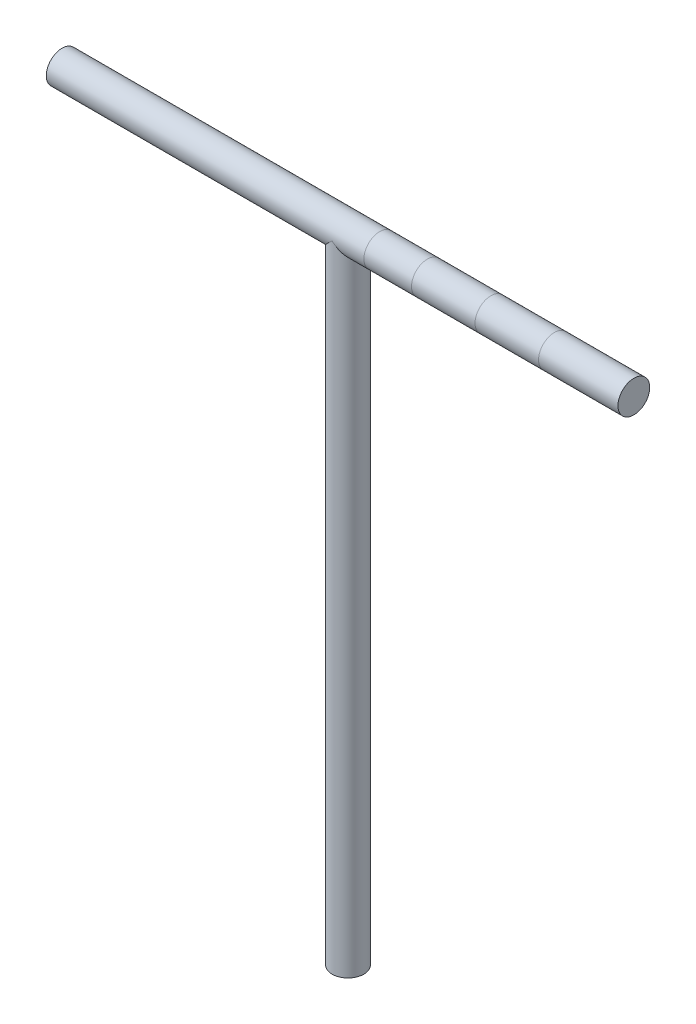
ISO-10303-21;
HEADER;
FILE_DESCRIPTION(('STEP AP214'),'2;1');
FILE_NAME('part.step','',(''),(''),'','','');
FILE_SCHEMA(('AUTOMOTIVE_DESIGN { 1 0 10303 214 1 1 1 1 }'));
ENDSEC;
DATA;
#1=APPLICATION_CONTEXT('core data for automotive mechanical design processes');
#2=APPLICATION_PROTOCOL_DEFINITION('international standard','automotive_design',2000,#1);
#3=PRODUCT_CONTEXT('',#1,'mechanical');
#4=PRODUCT('Part','Part','',(#3));
#5=PRODUCT_RELATED_PRODUCT_CATEGORY('part','',(#4));
#6=PRODUCT_DEFINITION_FORMATION('','',#4);
#7=PRODUCT_DEFINITION_CONTEXT('part definition',#1,'design');
#8=PRODUCT_DEFINITION('design','',#6,#7);
#9=PRODUCT_DEFINITION_SHAPE('','',#8);
#10=(LENGTH_UNIT() NAMED_UNIT(*) SI_UNIT(.MILLI.,.METRE.));
#11=(NAMED_UNIT(*) PLANE_ANGLE_UNIT() SI_UNIT($,.RADIAN.));
#12=(NAMED_UNIT(*) SI_UNIT($,.STERADIAN.) SOLID_ANGLE_UNIT());
#13=UNCERTAINTY_MEASURE_WITH_UNIT(LENGTH_MEASURE(1.E-05),#10,'distance_accuracy_value','');
#14=(GEOMETRIC_REPRESENTATION_CONTEXT(3) GLOBAL_UNCERTAINTY_ASSIGNED_CONTEXT((#13)) GLOBAL_UNIT_ASSIGNED_CONTEXT((#10,
#11,#12)) REPRESENTATION_CONTEXT('',''));
#15=CARTESIAN_POINT('',(0.,0.,0.));
#16=DIRECTION('',(0.,0.,1.));
#17=DIRECTION('',(1.,0.,0.));
#18=AXIS2_PLACEMENT_3D('',#15,#16,#17);
#19=CARTESIAN_POINT('',(90.,0.,0.));
#20=DIRECTION('',(-1.,0.,0.));
#21=DIRECTION('',(0.,0.,1.));
#22=AXIS2_PLACEMENT_3D('',#19,#20,#21);
#23=CYLINDRICAL_SURFACE('',#22,5.);
#24=CARTESIAN_POINT('',(90.,0.,0.));
#25=DIRECTION('',(1.,0.,0.));
#26=DIRECTION('',(0.,0.,-1.));
#27=AXIS2_PLACEMENT_3D('',#24,#25,#26);
#28=CIRCLE('',#27,5.);
#29=CARTESIAN_POINT('',(90.,0.,-5.));
#30=VERTEX_POINT('',#29);
#31=EDGE_CURVE('E68',#30,#30,#28,.T.);
#32=ORIENTED_EDGE('',*,*,#31,.F.);
#33=EDGE_LOOP('',(#32));
#34=FACE_BOUND('',#33,.T.);
#35=CARTESIAN_POINT('',(65.,0.,0.));
#36=DIRECTION('',(1.,0.,0.));
#37=DIRECTION('',(0.,0.,-1.));
#38=AXIS2_PLACEMENT_3D('',#35,#36,#37);
#39=CIRCLE('',#38,5.);
#40=CARTESIAN_POINT('',(65.,0.,-5.));
#41=VERTEX_POINT('',#40);
#42=EDGE_CURVE('E55',#41,#41,#39,.T.);
#43=ORIENTED_EDGE('',*,*,#42,.T.);
#44=EDGE_LOOP('',(#43));
#45=FACE_BOUND('',#44,.T.);
#46=ADVANCED_FACE('F39',(#34,#45),#23,.T.);
#47=ORIENTED_EDGE('',*,*,#42,.F.);
#48=EDGE_LOOP('',(#47));
#49=FACE_BOUND('',#48,.T.);
#50=CARTESIAN_POINT('',(45.,0.,0.));
#51=DIRECTION('',(1.,0.,0.));
#52=DIRECTION('',(0.,0.,-1.));
#53=AXIS2_PLACEMENT_3D('',#50,#51,#52);
#54=CIRCLE('',#53,5.);
#55=CARTESIAN_POINT('',(45.,0.,-5.));
#56=VERTEX_POINT('',#55);
#57=EDGE_CURVE('E80',#56,#56,#54,.T.);
#58=ORIENTED_EDGE('',*,*,#57,.T.);
#59=EDGE_LOOP('',(#58));
#60=FACE_BOUND('',#59,.T.);
#61=ADVANCED_FACE('F87',(#49,#60),#23,.T.);
#62=ORIENTED_EDGE('',*,*,#57,.F.);
#63=EDGE_LOOP('',(#62));
#64=FACE_BOUND('',#63,.T.);
#65=CARTESIAN_POINT('',(25.,0.,0.));
#66=DIRECTION('',(1.,0.,0.));
#67=DIRECTION('',(0.,0.,-1.));
#68=AXIS2_PLACEMENT_3D('',#65,#66,#67);
#69=CIRCLE('',#68,5.);
#70=CARTESIAN_POINT('',(25.,0.,-5.));
#71=VERTEX_POINT('',#70);
#72=EDGE_CURVE('E77',#71,#71,#69,.T.);
#73=ORIENTED_EDGE('',*,*,#72,.T.);
#74=EDGE_LOOP('',(#73));
#75=FACE_BOUND('',#74,.T.);
#76=ADVANCED_FACE('F90',(#64,#75),#23,.T.);
#77=ORIENTED_EDGE('',*,*,#72,.F.);
#78=EDGE_LOOP('',(#77));
#79=FACE_BOUND('',#78,.T.);
#80=CARTESIAN_POINT('',(9.99999999999999,0.,0.));
#81=DIRECTION('',(1.,0.,0.));
#82=DIRECTION('',(0.,0.,-1.));
#83=AXIS2_PLACEMENT_3D('',#80,#81,#82);
#84=CIRCLE('',#83,5.);
#85=CARTESIAN_POINT('',(9.99999999999999,0.,-5.));
#86=VERTEX_POINT('',#85);
#87=EDGE_CURVE('E63',#86,#86,#84,.T.);
#88=ORIENTED_EDGE('',*,*,#87,.T.);
#89=EDGE_LOOP('',(#88));
#90=FACE_BOUND('',#89,.T.);
#91=ADVANCED_FACE('F59',(#79,#90),#23,.T.);
#92=CARTESIAN_POINT('',(0.,0.,0.));
#93=DIRECTION('',(-0.707106781186547,-0.707106781186548,0.));
#94=DIRECTION('',(-0.707106781186547,0.707106781186548,0.));
#95=AXIS2_PLACEMENT_3D('',#92,#93,#94);
#96=ELLIPSE('',#95,7.07106781186547,5.);
#97=CARTESIAN_POINT('',(0.,0.,5.));
#98=VERTEX_POINT('',#97);
#99=CARTESIAN_POINT('',(0.,0.,-5.));
#100=VERTEX_POINT('',#99);
#101=EDGE_CURVE('E47',#98,#100,#96,.F.);
#102=ORIENTED_EDGE('',*,*,#101,.T.);
#103=CARTESIAN_POINT('',(0.,0.,0.));
#104=DIRECTION('',(-0.707106781186547,0.707106781186548,0.));
#105=DIRECTION('',(-0.707106781186547,-0.707106781186548,0.));
#106=AXIS2_PLACEMENT_3D('',#103,#104,#105);
#107=ELLIPSE('',#106,7.07106781186547,5.);
#108=EDGE_CURVE('E12',#100,#98,#107,.T.);
#109=ORIENTED_EDGE('',*,*,#108,.T.);
#110=EDGE_LOOP('',(#102,#109));
#111=FACE_BOUND('',#110,.T.);
#112=ORIENTED_EDGE('',*,*,#87,.F.);
#113=EDGE_LOOP('',(#112));
#114=FACE_BOUND('',#113,.T.);
#115=CARTESIAN_POINT('',(-90.,0.,0.));
#116=DIRECTION('',(1.,0.,0.));
#117=DIRECTION('',(0.,0.,-1.));
#118=AXIS2_PLACEMENT_3D('',#115,#116,#117);
#119=CIRCLE('',#118,5.);
#120=CARTESIAN_POINT('',(-90.,0.,-5.));
#121=VERTEX_POINT('',#120);
#122=EDGE_CURVE('E66',#121,#121,#119,.T.);
#123=ORIENTED_EDGE('',*,*,#122,.T.);
#124=EDGE_LOOP('',(#123));
#125=FACE_BOUND('',#124,.T.);
#126=ADVANCED_FACE('F41',(#111,#114,#125),#23,.T.);
#127=CARTESIAN_POINT('',(90.,0.,0.));
#128=DIRECTION('',(1.,0.,0.));
#129=DIRECTION('',(0.,0.,-1.));
#130=AXIS2_PLACEMENT_3D('',#127,#128,#129);
#131=PLANE('',#130);
#132=ORIENTED_EDGE('',*,*,#31,.T.);
#133=EDGE_LOOP('',(#132));
#134=FACE_BOUND('',#133,.T.);
#135=ADVANCED_FACE('F58',(#134),#131,.T.);
#136=CARTESIAN_POINT('',(-90.,0.,0.));
#137=DIRECTION('',(1.,0.,0.));
#138=DIRECTION('',(0.,0.,-1.));
#139=AXIS2_PLACEMENT_3D('',#136,#137,#138);
#140=PLANE('',#139);
#141=ORIENTED_EDGE('',*,*,#122,.F.);
#142=EDGE_LOOP('',(#141));
#143=FACE_BOUND('',#142,.T.);
#144=ADVANCED_FACE('F108',(#143),#140,.F.);
#145=CARTESIAN_POINT('',(0.,-200.,0.));
#146=DIRECTION('',(0.,1.,0.));
#147=DIRECTION('',(0.,0.,1.));
#148=AXIS2_PLACEMENT_3D('',#145,#146,#147);
#149=CYLINDRICAL_SURFACE('',#148,5.);
#150=CARTESIAN_POINT('',(0.,-200.,0.));
#151=DIRECTION('',(0.,1.,0.));
#152=DIRECTION('',(0.,0.,1.));
#153=AXIS2_PLACEMENT_3D('',#150,#151,#152);
#154=CIRCLE('',#153,5.);
#155=CARTESIAN_POINT('',(0.,-200.,5.));
#156=VERTEX_POINT('',#155);
#157=EDGE_CURVE('E69',#156,#156,#154,.T.);
#158=ORIENTED_EDGE('',*,*,#157,.T.);
#159=EDGE_LOOP('',(#158));
#160=FACE_BOUND('',#159,.T.);
#161=ORIENTED_EDGE('',*,*,#108,.F.);
#162=ORIENTED_EDGE('',*,*,#101,.F.);
#163=EDGE_LOOP('',(#161,#162));
#164=FACE_BOUND('',#163,.T.);
#165=ADVANCED_FACE('F53',(#160,#164),#149,.T.);
#166=CARTESIAN_POINT('',(0.,-200.,0.));
#167=DIRECTION('',(0.,1.,0.));
#168=DIRECTION('',(0.,0.,1.));
#169=AXIS2_PLACEMENT_3D('',#166,#167,#168);
#170=PLANE('',#169);
#171=ORIENTED_EDGE('',*,*,#157,.F.);
#172=EDGE_LOOP('',(#171));
#173=FACE_BOUND('',#172,.T.);
#174=ADVANCED_FACE('F116',(#173),#170,.F.);
#175=CLOSED_SHELL('',(#46,#61,#76,#91,#126,#135,#144,#165,#174));
#176=MANIFOLD_SOLID_BREP('B2',#175);
#177=ADVANCED_BREP_SHAPE_REPRESENTATION('',(#18,#176),#14);
#178=SHAPE_DEFINITION_REPRESENTATION(#9,#177);
ENDSEC;
END-ISO-10303-21;
